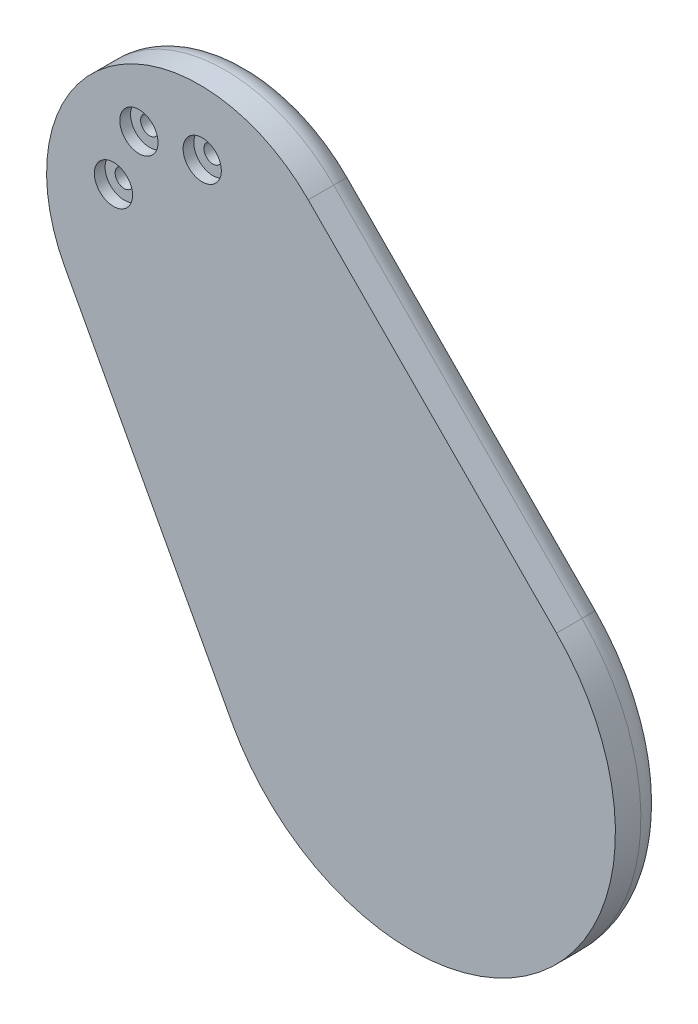
ISO-10303-21;
HEADER;
FILE_DESCRIPTION(('STEP AP214'),'2;1');
FILE_NAME('part.step','',(''),(''),'','','');
FILE_SCHEMA(('AUTOMOTIVE_DESIGN { 1 0 10303 214 1 1 1 1 }'));
ENDSEC;
DATA;
#1=APPLICATION_CONTEXT('core data for automotive mechanical design processes');
#2=APPLICATION_PROTOCOL_DEFINITION('international standard','automotive_design',2000,#1);
#3=PRODUCT_CONTEXT('',#1,'mechanical');
#4=PRODUCT('Part','Part','',(#3));
#5=PRODUCT_RELATED_PRODUCT_CATEGORY('part','',(#4));
#6=PRODUCT_DEFINITION_FORMATION('','',#4);
#7=PRODUCT_DEFINITION_CONTEXT('part definition',#1,'design');
#8=PRODUCT_DEFINITION('design','',#6,#7);
#9=PRODUCT_DEFINITION_SHAPE('','',#8);
#10=(LENGTH_UNIT() NAMED_UNIT(*) SI_UNIT(.MILLI.,.METRE.));
#11=(NAMED_UNIT(*) PLANE_ANGLE_UNIT() SI_UNIT($,.RADIAN.));
#12=(NAMED_UNIT(*) SI_UNIT($,.STERADIAN.) SOLID_ANGLE_UNIT());
#13=UNCERTAINTY_MEASURE_WITH_UNIT(LENGTH_MEASURE(1.E-05),#10,'distance_accuracy_value','');
#14=(GEOMETRIC_REPRESENTATION_CONTEXT(3) GLOBAL_UNCERTAINTY_ASSIGNED_CONTEXT((#13)) GLOBAL_UNIT_ASSIGNED_CONTEXT((#10,
#11,#12)) REPRESENTATION_CONTEXT('',''));
#15=CARTESIAN_POINT('',(0.,0.,0.));
#16=DIRECTION('',(0.,0.,1.));
#17=DIRECTION('',(1.,0.,0.));
#18=AXIS2_PLACEMENT_3D('',#15,#16,#17);
#19=CARTESIAN_POINT('',(0.,0.,-1.26999999999997));
#20=DIRECTION('',(0.,0.,1.));
#21=DIRECTION('',(1.,0.,0.));
#22=AXIS2_PLACEMENT_3D('',#19,#20,#21);
#23=PLANE('',#22);
#24=CARTESIAN_POINT('',(-52.1519440719628,93.7132213431746,-1.26999999999997));
#25=DIRECTION('',(0.,0.,1.));
#26=DIRECTION('',(1.,0.,0.));
#27=AXIS2_PLACEMENT_3D('',#24,#25,#26);
#28=CIRCLE('',#27,2.2479);
#29=CARTESIAN_POINT('',(-49.9040440719628,93.7132213431746,-1.26999999999997));
#30=VERTEX_POINT('',#29);
#31=EDGE_CURVE('E306',#30,#30,#28,.F.);
#32=ORIENTED_EDGE('',*,*,#31,.F.);
#33=EDGE_LOOP('',(#32));
#34=FACE_BOUND('',#33,.T.);
#35=CARTESIAN_POINT('',(0.,0.,-1.26999999999997));
#36=DIRECTION('',(0.,0.,1.));
#37=DIRECTION('',(1.,0.,0.));
#38=AXIS2_PLACEMENT_3D('',#35,#36,#37);
#39=CIRCLE('',#38,16.42872);
#40=CARTESIAN_POINT('',(16.42872,0.,-1.26999999999997));
#41=VERTEX_POINT('',#40);
#42=EDGE_CURVE('E150',#41,#41,#39,.T.);
#43=ORIENTED_EDGE('',*,*,#42,.T.);
#44=EDGE_LOOP('',(#43));
#45=FACE_BOUND('',#44,.T.);
#46=CARTESIAN_POINT('',(-52.8314178694251,71.4986103774484,-1.26999999999997));
#47=DIRECTION('',(0.,0.,1.));
#48=DIRECTION('',(1.,0.,0.));
#49=AXIS2_PLACEMENT_3D('',#46,#47,#48);
#50=CIRCLE('',#49,10.17778);
#51=CARTESIAN_POINT('',(-42.653637869425,71.4986103774484,-1.26999999999997));
#52=VERTEX_POINT('',#51);
#53=EDGE_CURVE('E147',#52,#52,#50,.T.);
#54=ORIENTED_EDGE('',*,*,#53,.T.);
#55=EDGE_LOOP('',(#54));
#56=FACE_BOUND('',#55,.T.);
#57=CARTESIAN_POINT('',(-52.8314178694251,71.4986103774484,-1.26999999999997));
#58=DIRECTION('',(0.,0.,1.));
#59=DIRECTION('',(1.,0.,0.));
#60=AXIS2_PLACEMENT_3D('',#57,#58,#59);
#61=CIRCLE('',#60,31.7499999999999);
#62=CARTESIAN_POINT('',(-80.8002097697655,56.4716619302272,-1.26999999999997));
#63=VERTEX_POINT('',#62);
#64=CARTESIAN_POINT('',(-30.2535869761689,93.8213353937971,-1.26999999999997));
#65=VERTEX_POINT('',#64);
#66=EDGE_CURVE('E121',#63,#65,#61,.F.);
#67=ORIENTED_EDGE('',*,*,#66,.T.);
#68=DIRECTION('',(-0.703077953270827,0.711112784039568,0.));
#69=VECTOR('',#68,1.);
#70=CARTESIAN_POINT('',(31.6089632505588,31.2518150228883,-1.26999999999997));
#71=LINE('',#70,#69);
#72=CARTESIAN_POINT('',(31.6089632505588,31.2518150228883,-1.26999999999997));
#73=VERTEX_POINT('',#72);
#74=EDGE_CURVE('E127',#65,#73,#71,.F.);
#75=ORIENTED_EDGE('',*,*,#74,.T.);
#76=CARTESIAN_POINT('',(0.,0.,-1.26999999999997));
#77=DIRECTION('',(0.,0.,1.));
#78=DIRECTION('',(1.,0.,0.));
#79=AXIS2_PLACEMENT_3D('',#76,#77,#78);
#80=CIRCLE('',#79,44.45);
#81=CARTESIAN_POINT('',(-39.1563086604768,-21.0377278261098,-1.26999999999997));
#82=VERTEX_POINT('',#81);
#83=EDGE_CURVE('E125',#73,#82,#80,.F.);
#84=ORIENTED_EDGE('',*,*,#83,.T.);
#85=DIRECTION('',(0.473289714873111,-0.880906831506789,0.));
#86=VECTOR('',#85,1.);
#87=CARTESIAN_POINT('',(-39.1563086604768,-21.0377278261098,-1.26999999999997));
#88=LINE('',#87,#86);
#89=EDGE_CURVE('E123',#82,#63,#88,.F.);
#90=ORIENTED_EDGE('',*,*,#89,.T.);
#91=EDGE_LOOP('',(#67,#75,#84,#90));
#92=FACE_BOUND('',#91,.T.);
#93=CARTESIAN_POINT('',(-74.2660915441615,77.3727392028627,-1.26999999999997));
#94=DIRECTION('',(0.,0.,1.));
#95=DIRECTION('',(1.,0.,0.));
#96=AXIS2_PLACEMENT_3D('',#93,#94,#95);
#97=CIRCLE('',#96,2.2479);
#98=CARTESIAN_POINT('',(-72.0181915441615,77.3727392028627,-1.26999999999997));
#99=VERTEX_POINT('',#98);
#100=EDGE_CURVE('E137',#99,#99,#97,.F.);
#101=ORIENTED_EDGE('',*,*,#100,.F.);
#102=EDGE_LOOP('',(#101));
#103=FACE_BOUND('',#102,.T.);
#104=CARTESIAN_POINT('',(-67.9261086892609,91.9267847710052,-1.26999999999997));
#105=DIRECTION('',(0.,0.,1.));
#106=DIRECTION('',(1.,0.,0.));
#107=AXIS2_PLACEMENT_3D('',#104,#105,#106);
#108=CIRCLE('',#107,2.2479);
#109=CARTESIAN_POINT('',(-65.6782086892609,91.9267847710052,-1.26999999999997));
#110=VERTEX_POINT('',#109);
#111=EDGE_CURVE('E288',#110,#110,#108,.F.);
#112=ORIENTED_EDGE('',*,*,#111,.F.);
#113=EDGE_LOOP('',(#112));
#114=FACE_BOUND('',#113,.T.);
#115=ADVANCED_FACE('F32',(#34,#45,#56,#92,#103,#114),#23,.F.);
#116=CARTESIAN_POINT('',(0.,0.,11.43));
#117=DIRECTION('',(0.,0.,-1.));
#118=DIRECTION('',(-1.,0.,0.));
#119=AXIS2_PLACEMENT_3D('',#116,#117,#118);
#120=CYLINDRICAL_SURFACE('',#119,50.8);
#121=DIRECTION('',(0.,0.,-1.));
#122=VECTOR('',#121,1.);
#123=CARTESIAN_POINT('',(-44.7500670405449,-24.0431175155541,11.43));
#124=LINE('',#123,#122);
#125=CARTESIAN_POINT('',(-44.7500670405449,-24.0431175155541,11.43));
#126=VERTEX_POINT('',#125);
#127=CARTESIAN_POINT('',(-44.7500670405449,-24.0431175155541,5.08000000000003));
#128=VERTEX_POINT('',#127);
#129=EDGE_CURVE('E272',#126,#128,#124,.T.);
#130=ORIENTED_EDGE('',*,*,#129,.T.);
#131=CARTESIAN_POINT('',(0.,0.,5.08000000000003));
#132=DIRECTION('',(0.,0.,1.));
#133=DIRECTION('',(1.,0.,0.));
#134=AXIS2_PLACEMENT_3D('',#131,#132,#133);
#135=CIRCLE('',#134,50.8);
#136=CARTESIAN_POINT('',(36.1245294292101,35.716360026158,5.08000000000003));
#137=VERTEX_POINT('',#136);
#138=EDGE_CURVE('E110',#128,#137,#135,.T.);
#139=ORIENTED_EDGE('',*,*,#138,.T.);
#140=DIRECTION('',(0.,0.,-1.));
#141=VECTOR('',#140,1.);
#142=CARTESIAN_POINT('',(36.1245294292101,35.716360026158,11.43));
#143=LINE('',#142,#141);
#144=CARTESIAN_POINT('',(36.1245294292101,35.716360026158,11.43));
#145=VERTEX_POINT('',#144);
#146=EDGE_CURVE('E93',#145,#137,#143,.T.);
#147=ORIENTED_EDGE('',*,*,#146,.F.);
#148=CARTESIAN_POINT('',(0.,0.,11.43));
#149=DIRECTION('',(0.,0.,1.));
#150=DIRECTION('',(1.,0.,0.));
#151=AXIS2_PLACEMENT_3D('',#148,#149,#150);
#152=CIRCLE('',#151,50.8);
#153=EDGE_CURVE('E99',#126,#145,#152,.T.);
#154=ORIENTED_EDGE('',*,*,#153,.F.);
#155=EDGE_LOOP('',(#130,#139,#147,#154));
#156=FACE_BOUND('',#155,.T.);
#157=ADVANCED_FACE('F108',(#156),#120,.T.);
#158=CARTESIAN_POINT('',(-25.7380207975176,98.2858803970668,11.43));
#159=DIRECTION('',(-0.711112784039568,-0.703077953270827,0.));
#160=DIRECTION('',(0.703077953270827,-0.711112784039568,0.));
#161=AXIS2_PLACEMENT_3D('',#158,#159,#160);
#162=PLANE('',#161);
#163=ORIENTED_EDGE('',*,*,#146,.T.);
#164=DIRECTION('',(-0.703077953270827,0.711112784039568,0.));
#165=VECTOR('',#164,1.);
#166=CARTESIAN_POINT('',(-25.7380207975176,98.2858803970668,5.08000000000003));
#167=LINE('',#166,#165);
#168=CARTESIAN_POINT('',(-25.7380207975176,98.2858803970668,5.08000000000003));
#169=VERTEX_POINT('',#168);
#170=EDGE_CURVE('E114',#137,#169,#167,.T.);
#171=ORIENTED_EDGE('',*,*,#170,.T.);
#172=DIRECTION('',(0.,0.,-1.));
#173=VECTOR('',#172,1.);
#174=CARTESIAN_POINT('',(-25.7380207975176,98.2858803970668,11.43));
#175=LINE('',#174,#173);
#176=CARTESIAN_POINT('',(-25.7380207975176,98.2858803970668,11.43));
#177=VERTEX_POINT('',#176);
#178=EDGE_CURVE('E95',#177,#169,#175,.T.);
#179=ORIENTED_EDGE('',*,*,#178,.F.);
#180=DIRECTION('',(-0.703077953270827,0.711112784039568,0.));
#181=VECTOR('',#180,1.);
#182=CARTESIAN_POINT('',(-25.7380207975176,98.2858803970668,11.43));
#183=LINE('',#182,#181);
#184=EDGE_CURVE('E88',#145,#177,#183,.T.);
#185=ORIENTED_EDGE('',*,*,#184,.F.);
#186=EDGE_LOOP('',(#163,#171,#179,#185));
#187=FACE_BOUND('',#186,.T.);
#188=ADVANCED_FACE('F90',(#187),#162,.F.);
#189=CARTESIAN_POINT('',(-52.8314178694251,71.4986103774484,11.43));
#190=DIRECTION('',(0.,0.,-1.));
#191=DIRECTION('',(-1.,0.,0.));
#192=AXIS2_PLACEMENT_3D('',#189,#190,#191);
#193=CYLINDRICAL_SURFACE('',#192,38.0999999999999);
#194=ORIENTED_EDGE('',*,*,#178,.T.);
#195=CARTESIAN_POINT('',(-52.8314178694251,71.4986103774484,5.08000000000003));
#196=DIRECTION('',(0.,0.,1.));
#197=DIRECTION('',(1.,0.,0.));
#198=AXIS2_PLACEMENT_3D('',#195,#196,#197);
#199=CIRCLE('',#198,38.0999999999999);
#200=CARTESIAN_POINT('',(-86.3939681498336,53.4662722407829,5.08000000000003));
#201=VERTEX_POINT('',#200);
#202=EDGE_CURVE('E47',#169,#201,#199,.T.);
#203=ORIENTED_EDGE('',*,*,#202,.T.);
#204=DIRECTION('',(0.,0.,-1.));
#205=VECTOR('',#204,1.);
#206=CARTESIAN_POINT('',(-86.3939681498336,53.4662722407829,11.43));
#207=LINE('',#206,#205);
#208=CARTESIAN_POINT('',(-86.3939681498336,53.4662722407829,11.43));
#209=VERTEX_POINT('',#208);
#210=EDGE_CURVE('E116',#209,#201,#207,.T.);
#211=ORIENTED_EDGE('',*,*,#210,.F.);
#212=CARTESIAN_POINT('',(-52.8314178694251,71.4986103774484,11.43));
#213=DIRECTION('',(0.,0.,1.));
#214=DIRECTION('',(1.,0.,0.));
#215=AXIS2_PLACEMENT_3D('',#212,#213,#214);
#216=CIRCLE('',#215,38.0999999999999);
#217=EDGE_CURVE('E98',#177,#209,#216,.T.);
#218=ORIENTED_EDGE('',*,*,#217,.F.);
#219=EDGE_LOOP('',(#194,#203,#211,#218));
#220=FACE_BOUND('',#219,.T.);
#221=ADVANCED_FACE('F208',(#220),#193,.T.);
#222=CARTESIAN_POINT('',(-44.7500670405449,-24.0431175155541,11.43));
#223=DIRECTION('',(0.880906831506788,0.473289714873111,0.));
#224=DIRECTION('',(-0.473289714873111,0.880906831506789,0.));
#225=AXIS2_PLACEMENT_3D('',#222,#223,#224);
#226=PLANE('',#225);
#227=ORIENTED_EDGE('',*,*,#210,.T.);
#228=DIRECTION('',(0.473289714873111,-0.880906831506789,0.));
#229=VECTOR('',#228,1.);
#230=CARTESIAN_POINT('',(-44.7500670405449,-24.0431175155541,5.08000000000003));
#231=LINE('',#230,#229);
#232=EDGE_CURVE('E54',#201,#128,#231,.T.);
#233=ORIENTED_EDGE('',*,*,#232,.T.);
#234=ORIENTED_EDGE('',*,*,#129,.F.);
#235=DIRECTION('',(0.473289714873111,-0.880906831506788,0.));
#236=VECTOR('',#235,1.);
#237=CARTESIAN_POINT('',(-44.7500670405449,-24.0431175155541,11.43));
#238=LINE('',#237,#236);
#239=EDGE_CURVE('E104',#209,#126,#238,.T.);
#240=ORIENTED_EDGE('',*,*,#239,.F.);
#241=EDGE_LOOP('',(#227,#233,#234,#240));
#242=FACE_BOUND('',#241,.T.);
#243=ADVANCED_FACE('F205',(#242),#226,.F.);
#244=CARTESIAN_POINT('',(0.,0.,11.43));
#245=DIRECTION('',(0.,0.,1.));
#246=DIRECTION('',(1.,0.,0.));
#247=AXIS2_PLACEMENT_3D('',#244,#245,#246);
#248=PLANE('',#247);
#249=CARTESIAN_POINT('',(-52.1519440719628,93.7132213431746,11.43));
#250=DIRECTION('',(0.,0.,1.));
#251=DIRECTION('',(1.,0.,0.));
#252=AXIS2_PLACEMENT_3D('',#249,#250,#251);
#253=CIRCLE('',#252,4.7625);
#254=CARTESIAN_POINT('',(-47.3894440719628,93.7132213431746,11.43));
#255=VERTEX_POINT('',#254);
#256=EDGE_CURVE('E512',#255,#255,#253,.T.);
#257=ORIENTED_EDGE('',*,*,#256,.F.);
#258=EDGE_LOOP('',(#257));
#259=FACE_BOUND('',#258,.T.);
#260=CARTESIAN_POINT('',(-67.9261086892609,91.9267847710052,11.43));
#261=DIRECTION('',(0.,0.,1.));
#262=DIRECTION('',(1.,0.,0.));
#263=AXIS2_PLACEMENT_3D('',#260,#261,#262);
#264=CIRCLE('',#263,4.76249999999999);
#265=CARTESIAN_POINT('',(-63.1636086892609,91.9267847710052,11.43));
#266=VERTEX_POINT('',#265);
#267=EDGE_CURVE('E303',#266,#266,#264,.T.);
#268=ORIENTED_EDGE('',*,*,#267,.F.);
#269=EDGE_LOOP('',(#268));
#270=FACE_BOUND('',#269,.T.);
#271=CARTESIAN_POINT('',(-74.2660915441615,77.3727392028627,11.43));
#272=DIRECTION('',(0.,0.,1.));
#273=DIRECTION('',(1.,0.,0.));
#274=AXIS2_PLACEMENT_3D('',#271,#272,#273);
#275=CIRCLE('',#274,4.76249999999999);
#276=CARTESIAN_POINT('',(-69.5035915441615,77.3727392028627,11.43));
#277=VERTEX_POINT('',#276);
#278=EDGE_CURVE('E290',#277,#277,#275,.T.);
#279=ORIENTED_EDGE('',*,*,#278,.F.);
#280=EDGE_LOOP('',(#279));
#281=FACE_BOUND('',#280,.T.);
#282=ORIENTED_EDGE('',*,*,#153,.T.);
#283=ORIENTED_EDGE('',*,*,#184,.T.);
#284=ORIENTED_EDGE('',*,*,#217,.T.);
#285=ORIENTED_EDGE('',*,*,#239,.T.);
#286=EDGE_LOOP('',(#282,#283,#284,#285));
#287=FACE_BOUND('',#286,.T.);
#288=ADVANCED_FACE('F102',(#259,#270,#281,#287),#248,.T.);
#289=CARTESIAN_POINT('',(0.,0.,-48.8082323760076));
#290=DIRECTION('',(0.,0.,1.));
#291=DIRECTION('',(1.,0.,0.));
#292=AXIS2_PLACEMENT_3D('',#289,#290,#291);
#293=CYLINDRICAL_SURFACE('',#292,13.88872);
#294=CARTESIAN_POINT('',(0.,0.,-9.27100000000261));
#295=DIRECTION('',(0.,0.,-1.));
#296=DIRECTION('',(-1.,0.,0.));
#297=AXIS2_PLACEMENT_3D('',#294,#295,#296);
#298=CIRCLE('',#297,13.88872);
#299=CARTESIAN_POINT('',(-13.88872,0.,-9.27100000000261));
#300=VERTEX_POINT('',#299);
#301=EDGE_CURVE('E171',#300,#300,#298,.F.);
#302=ORIENTED_EDGE('',*,*,#301,.T.);
#303=EDGE_LOOP('',(#302));
#304=FACE_BOUND('',#303,.T.);
#305=CARTESIAN_POINT('',(0.,0.,-3.80999999999997));
#306=DIRECTION('',(0.,0.,1.));
#307=DIRECTION('',(1.,0.,0.));
#308=AXIS2_PLACEMENT_3D('',#305,#306,#307);
#309=CIRCLE('',#308,13.88872);
#310=CARTESIAN_POINT('',(13.88872,0.,-3.80999999999997));
#311=VERTEX_POINT('',#310);
#312=EDGE_CURVE('E133',#311,#311,#309,.F.);
#313=ORIENTED_EDGE('',*,*,#312,.T.);
#314=EDGE_LOOP('',(#313));
#315=FACE_BOUND('',#314,.T.);
#316=ADVANCED_FACE('F334',(#304,#315),#293,.T.);
#317=CARTESIAN_POINT('',(0.974356089486769,-13.85450011546,-9.52500000000261));
#318=DIRECTION('',(0.,0.,-1.));
#319=DIRECTION('',(0.997536138352559,0.0701544915216637,0.));
#320=AXIS2_PLACEMENT_3D('',#317,#318,#319);
#321=PLANE('',#320);
#322=CARTESIAN_POINT('',(0.,0.,-9.52500000000261));
#323=DIRECTION('',(0.,0.,-1.));
#324=DIRECTION('',(-1.,0.,0.));
#325=AXIS2_PLACEMENT_3D('',#322,#323,#324);
#326=CIRCLE('',#325,13.63472);
#327=CARTESIAN_POINT('',(-13.63472,0.,-9.52500000000261));
#328=VERTEX_POINT('',#327);
#329=EDGE_CURVE('E168',#328,#328,#326,.T.);
#330=ORIENTED_EDGE('',*,*,#329,.T.);
#331=EDGE_LOOP('',(#330));
#332=FACE_BOUND('',#331,.T.);
#333=CARTESIAN_POINT('',(0.,0.,-9.52500000000262));
#334=DIRECTION('',(0.,0.,-1.));
#335=DIRECTION('',(-1.,0.,0.));
#336=AXIS2_PLACEMENT_3D('',#333,#334,#335);
#337=CIRCLE('',#336,6.35);
#338=CARTESIAN_POINT('',(-6.35,0.,-9.52500000000261));
#339=VERTEX_POINT('',#338);
#340=EDGE_CURVE('E111',#339,#339,#337,.F.);
#341=ORIENTED_EDGE('',*,*,#340,.T.);
#342=EDGE_LOOP('',(#341));
#343=FACE_BOUND('',#342,.T.);
#344=ADVANCED_FACE('F217',(#332,#343),#321,.T.);
#345=CARTESIAN_POINT('',(0.47345722929158,-6.73215193979104,-15.8750000000026));
#346=DIRECTION('',(0.,0.,1.));
#347=DIRECTION('',(-0.997536138352559,-0.0701544915216637,0.));
#348=AXIS2_PLACEMENT_3D('',#345,#346,#347);
#349=PLANE('',#348);
#350=CARTESIAN_POINT('',(0.,0.,-15.8750000000026));
#351=DIRECTION('',(0.,0.,1.));
#352=DIRECTION('',(1.,0.,0.));
#353=AXIS2_PLACEMENT_3D('',#350,#351,#352);
#354=CIRCLE('',#353,5.715);
#355=CARTESIAN_POINT('',(5.715,0.,-15.8750000000026));
#356=VERTEX_POINT('',#355);
#357=EDGE_CURVE('E156',#356,#356,#354,.F.);
#358=ORIENTED_EDGE('',*,*,#357,.T.);
#359=EDGE_LOOP('',(#358));
#360=FACE_BOUND('',#359,.T.);
#361=ADVANCED_FACE('F213',(#360),#349,.F.);
#362=CARTESIAN_POINT('',(0.,0.,-33.8355122421409));
#363=DIRECTION('',(0.,0.,1.));
#364=DIRECTION('',(1.,0.,0.));
#365=AXIS2_PLACEMENT_3D('',#362,#363,#364);
#366=CYLINDRICAL_SURFACE('',#365,6.35);
#367=CARTESIAN_POINT('',(0.,0.,-15.2400000000026));
#368=DIRECTION('',(0.,0.,1.));
#369=DIRECTION('',(1.,0.,0.));
#370=AXIS2_PLACEMENT_3D('',#367,#368,#369);
#371=CIRCLE('',#370,6.35);
#372=CARTESIAN_POINT('',(6.35,0.,-15.2400000000026));
#373=VERTEX_POINT('',#372);
#374=EDGE_CURVE('E159',#373,#373,#371,.T.);
#375=ORIENTED_EDGE('',*,*,#374,.T.);
#376=EDGE_LOOP('',(#375));
#377=FACE_BOUND('',#376,.T.);
#378=ORIENTED_EDGE('',*,*,#340,.F.);
#379=EDGE_LOOP('',(#378));
#380=FACE_BOUND('',#379,.T.);
#381=ADVANCED_FACE('F216',(#377,#380),#366,.T.);
#382=CARTESIAN_POINT('',(-52.8314178694251,71.4986103774484,-28.0545041248458));
#383=DIRECTION('',(0.,0.,1.));
#384=DIRECTION('',(1.,0.,0.));
#385=AXIS2_PLACEMENT_3D('',#382,#383,#384);
#386=CYLINDRICAL_SURFACE('',#385,7.63778000000001);
#387=CARTESIAN_POINT('',(-52.8314178694251,71.4986103774484,-6.19760000000179));
#388=DIRECTION('',(0.,0.,-1.));
#389=DIRECTION('',(-1.,0.,0.));
#390=AXIS2_PLACEMENT_3D('',#387,#388,#389);
#391=CIRCLE('',#390,7.63778000000001);
#392=CARTESIAN_POINT('',(-60.4691978694251,71.4986103774484,-6.19760000000179));
#393=VERTEX_POINT('',#392);
#394=EDGE_CURVE('E11',#393,#393,#391,.F.);
#395=ORIENTED_EDGE('',*,*,#394,.T.);
#396=EDGE_LOOP('',(#395));
#397=FACE_BOUND('',#396,.T.);
#398=CARTESIAN_POINT('',(-52.8314178694251,71.4986103774484,-3.80999999999997));
#399=DIRECTION('',(0.,0.,1.));
#400=DIRECTION('',(1.,0.,0.));
#401=AXIS2_PLACEMENT_3D('',#398,#399,#400);
#402=CIRCLE('',#401,7.63778000000001);
#403=CARTESIAN_POINT('',(-45.193637869425,71.4986103774484,-3.80999999999997));
#404=VERTEX_POINT('',#403);
#405=EDGE_CURVE('E153',#404,#404,#402,.F.);
#406=ORIENTED_EDGE('',*,*,#405,.T.);
#407=EDGE_LOOP('',(#406));
#408=FACE_BOUND('',#407,.T.);
#409=ADVANCED_FACE('F221',(#397,#408),#386,.T.);
#410=CARTESIAN_POINT('',(-45.3800836815725,73.1759004982502,-6.4516000000018));
#411=DIRECTION('',(0.,0.,-1.));
#412=DIRECTION('',(-0.219604403478726,0.975589004639122,0.));
#413=AXIS2_PLACEMENT_3D('',#410,#411,#412);
#414=PLANE('',#413);
#415=CARTESIAN_POINT('',(-52.8314178694251,71.4986103774484,-6.45160000000179));
#416=DIRECTION('',(0.,0.,-1.));
#417=DIRECTION('',(-1.,0.,0.));
#418=AXIS2_PLACEMENT_3D('',#415,#416,#417);
#419=CIRCLE('',#418,7.38378000000001);
#420=CARTESIAN_POINT('',(-60.2151978694251,71.4986103774484,-6.45160000000179));
#421=VERTEX_POINT('',#420);
#422=EDGE_CURVE('E40',#421,#421,#419,.T.);
#423=ORIENTED_EDGE('',*,*,#422,.T.);
#424=EDGE_LOOP('',(#423));
#425=FACE_BOUND('',#424,.T.);
#426=CARTESIAN_POINT('',(-52.8314178694251,71.4986103774485,-6.45160000000179));
#427=DIRECTION('',(0.,0.,-1.));
#428=DIRECTION('',(-1.,0.,0.));
#429=AXIS2_PLACEMENT_3D('',#426,#427,#428);
#430=CIRCLE('',#429,3.175);
#431=CARTESIAN_POINT('',(-56.0064178694251,71.4986103774485,-6.45160000000179));
#432=VERTEX_POINT('',#431);
#433=EDGE_CURVE('E106',#432,#432,#430,.T.);
#434=ORIENTED_EDGE('',*,*,#433,.F.);
#435=EDGE_LOOP('',(#434));
#436=FACE_BOUND('',#435,.T.);
#437=ADVANCED_FACE('F176',(#425,#436),#414,.T.);
#438=CARTESIAN_POINT('',(-49.4415192432254,72.261674190304,-11.4300000000018));
#439=DIRECTION('',(0.,0.,1.));
#440=DIRECTION('',(0.219604403478726,-0.975589004639122,0.));
#441=AXIS2_PLACEMENT_3D('',#438,#439,#440);
#442=PLANE('',#441);
#443=CARTESIAN_POINT('',(-52.8314178694251,71.4986103774485,-11.4300000000018));
#444=DIRECTION('',(0.,0.,1.));
#445=DIRECTION('',(1.,0.,0.));
#446=AXIS2_PLACEMENT_3D('',#443,#444,#445);
#447=CIRCLE('',#446,2.54);
#448=CARTESIAN_POINT('',(-50.2914178694251,71.4986103774485,-11.4300000000018));
#449=VERTEX_POINT('',#448);
#450=EDGE_CURVE('E165',#449,#449,#447,.F.);
#451=ORIENTED_EDGE('',*,*,#450,.T.);
#452=EDGE_LOOP('',(#451));
#453=FACE_BOUND('',#452,.T.);
#454=ADVANCED_FACE('F262',(#453),#442,.F.);
#455=CARTESIAN_POINT('',(-52.8314178694251,71.4986103774485,-20.4102561210709));
#456=DIRECTION('',(0.,0.,1.));
#457=DIRECTION('',(1.,0.,0.));
#458=AXIS2_PLACEMENT_3D('',#455,#456,#457);
#459=CYLINDRICAL_SURFACE('',#458,3.175);
#460=CARTESIAN_POINT('',(-52.8314178694251,71.4986103774485,-10.7950000000018));
#461=DIRECTION('',(0.,0.,1.));
#462=DIRECTION('',(1.,0.,0.));
#463=AXIS2_PLACEMENT_3D('',#460,#461,#462);
#464=CIRCLE('',#463,3.175);
#465=CARTESIAN_POINT('',(-49.6564178694251,71.4986103774485,-10.7950000000018));
#466=VERTEX_POINT('',#465);
#467=EDGE_CURVE('E162',#466,#466,#464,.T.);
#468=ORIENTED_EDGE('',*,*,#467,.T.);
#469=EDGE_LOOP('',(#468));
#470=FACE_BOUND('',#469,.T.);
#471=ORIENTED_EDGE('',*,*,#433,.T.);
#472=EDGE_LOOP('',(#471));
#473=FACE_BOUND('',#472,.T.);
#474=ADVANCED_FACE('F239',(#470,#473),#459,.T.);
#475=CARTESIAN_POINT('',(-39.1563086604768,-21.0377278261098,5.08000000000003));
#476=DIRECTION('',(0.473289714873111,-0.880906831506789,0.));
#477=DIRECTION('',(0.880906831506788,0.473289714873111,0.));
#478=AXIS2_PLACEMENT_3D('',#475,#476,#477);
#479=CYLINDRICAL_SURFACE('',#478,6.35);
#480=CARTESIAN_POINT('',(-80.8002097697655,56.4716619302272,5.08000000000003));
#481=DIRECTION('',(-0.473289714873111,0.880906831506788,0.));
#482=DIRECTION('',(-0.880906831506788,-0.473289714873111,0.));
#483=AXIS2_PLACEMENT_3D('',#480,#481,#482);
#484=CIRCLE('',#483,6.35);
#485=EDGE_CURVE('E139',#63,#201,#484,.T.);
#486=ORIENTED_EDGE('',*,*,#485,.F.);
#487=ORIENTED_EDGE('',*,*,#89,.F.);
#488=CARTESIAN_POINT('',(-39.1563086604768,-21.0377278261098,5.08000000000003));
#489=DIRECTION('',(0.473289714873111,-0.880906831506788,0.));
#490=DIRECTION('',(0.880906831506788,0.473289714873111,0.));
#491=AXIS2_PLACEMENT_3D('',#488,#489,#490);
#492=CIRCLE('',#491,6.35);
#493=EDGE_CURVE('E142',#128,#82,#492,.T.);
#494=ORIENTED_EDGE('',*,*,#493,.F.);
#495=ORIENTED_EDGE('',*,*,#232,.F.);
#496=EDGE_LOOP('',(#486,#487,#494,#495));
#497=FACE_BOUND('',#496,.T.);
#498=ADVANCED_FACE('F235',(#497),#479,.T.);
#499=CARTESIAN_POINT('',(0.,0.,5.08000000000003));
#500=DIRECTION('',(0.,0.,1.));
#501=DIRECTION('',(1.,0.,0.));
#502=AXIS2_PLACEMENT_3D('',#499,#500,#501);
#503=TOROIDAL_SURFACE('',#502,44.45,6.35);
#504=ORIENTED_EDGE('',*,*,#493,.T.);
#505=ORIENTED_EDGE('',*,*,#83,.F.);
#506=CARTESIAN_POINT('',(31.6089632505588,31.2518150228883,5.08000000000003));
#507=DIRECTION('',(-0.703077953270827,0.711112784039568,0.));
#508=DIRECTION('',(-0.711112784039568,-0.703077953270827,0.));
#509=AXIS2_PLACEMENT_3D('',#506,#507,#508);
#510=CIRCLE('',#509,6.35);
#511=EDGE_CURVE('E136',#137,#73,#510,.T.);
#512=ORIENTED_EDGE('',*,*,#511,.F.);
#513=ORIENTED_EDGE('',*,*,#138,.F.);
#514=EDGE_LOOP('',(#504,#505,#512,#513));
#515=FACE_BOUND('',#514,.T.);
#516=ADVANCED_FACE('F231',(#515),#503,.T.);
#517=CARTESIAN_POINT('',(-52.8314178694251,71.4986103774484,5.08000000000003));
#518=DIRECTION('',(0.,0.,1.));
#519=DIRECTION('',(1.,0.,0.));
#520=AXIS2_PLACEMENT_3D('',#517,#518,#519);
#521=TOROIDAL_SURFACE('',#520,31.7499999999999,6.35);
#522=ORIENTED_EDGE('',*,*,#485,.T.);
#523=ORIENTED_EDGE('',*,*,#202,.F.);
#524=CARTESIAN_POINT('',(-30.2535869761689,93.8213353937971,5.08000000000003));
#525=DIRECTION('',(0.703077953270826,-0.711112784039568,0.));
#526=DIRECTION('',(0.711112784039568,0.703077953270826,0.));
#527=AXIS2_PLACEMENT_3D('',#524,#525,#526);
#528=CIRCLE('',#527,6.35);
#529=EDGE_CURVE('E134',#65,#169,#528,.T.);
#530=ORIENTED_EDGE('',*,*,#529,.F.);
#531=ORIENTED_EDGE('',*,*,#66,.F.);
#532=EDGE_LOOP('',(#522,#523,#530,#531));
#533=FACE_BOUND('',#532,.T.);
#534=ADVANCED_FACE('F227',(#533),#521,.T.);
#535=CARTESIAN_POINT('',(-30.2535869761688,93.8213353937971,5.08000000000003));
#536=DIRECTION('',(-0.703077953270827,0.711112784039568,0.));
#537=DIRECTION('',(-0.711112784039568,-0.703077953270827,0.));
#538=AXIS2_PLACEMENT_3D('',#535,#536,#537);
#539=CYLINDRICAL_SURFACE('',#538,6.35);
#540=ORIENTED_EDGE('',*,*,#511,.T.);
#541=ORIENTED_EDGE('',*,*,#74,.F.);
#542=ORIENTED_EDGE('',*,*,#529,.T.);
#543=ORIENTED_EDGE('',*,*,#170,.F.);
#544=EDGE_LOOP('',(#540,#541,#542,#543));
#545=FACE_BOUND('',#544,.T.);
#546=ADVANCED_FACE('F223',(#545),#539,.T.);
#547=CARTESIAN_POINT('',(0.,0.,-3.80999999999997));
#548=DIRECTION('',(0.,0.,1.));
#549=DIRECTION('',(1.,0.,0.));
#550=AXIS2_PLACEMENT_3D('',#547,#548,#549);
#551=TOROIDAL_SURFACE('',#550,16.42872,2.54);
#552=ORIENTED_EDGE('',*,*,#42,.F.);
#553=EDGE_LOOP('',(#552));
#554=FACE_BOUND('',#553,.T.);
#555=ORIENTED_EDGE('',*,*,#312,.F.);
#556=EDGE_LOOP('',(#555));
#557=FACE_BOUND('',#556,.T.);
#558=ADVANCED_FACE('F226',(#554,#557),#551,.F.);
#559=CARTESIAN_POINT('',(-52.8314178694251,71.4986103774484,-3.80999999999997));
#560=DIRECTION('',(0.,0.,1.));
#561=DIRECTION('',(1.,0.,0.));
#562=AXIS2_PLACEMENT_3D('',#559,#560,#561);
#563=TOROIDAL_SURFACE('',#562,10.17778,2.54);
#564=ORIENTED_EDGE('',*,*,#53,.F.);
#565=EDGE_LOOP('',(#564));
#566=FACE_BOUND('',#565,.T.);
#567=ORIENTED_EDGE('',*,*,#405,.F.);
#568=EDGE_LOOP('',(#567));
#569=FACE_BOUND('',#568,.T.);
#570=ADVANCED_FACE('F243',(#566,#569),#563,.F.);
#571=CARTESIAN_POINT('',(0.,0.,-15.2400000000026));
#572=DIRECTION('',(0.,0.,1.));
#573=DIRECTION('',(1.,0.,0.));
#574=AXIS2_PLACEMENT_3D('',#571,#572,#573);
#575=TOROIDAL_SURFACE('',#574,5.715,0.635);
#576=ORIENTED_EDGE('',*,*,#374,.F.);
#577=EDGE_LOOP('',(#576));
#578=FACE_BOUND('',#577,.T.);
#579=ORIENTED_EDGE('',*,*,#357,.F.);
#580=EDGE_LOOP('',(#579));
#581=FACE_BOUND('',#580,.T.);
#582=ADVANCED_FACE('F247',(#578,#581),#575,.T.);
#583=CARTESIAN_POINT('',(-52.8314178694251,71.4986103774485,-10.7950000000018));
#584=DIRECTION('',(0.,0.,1.));
#585=DIRECTION('',(1.,0.,0.));
#586=AXIS2_PLACEMENT_3D('',#583,#584,#585);
#587=TOROIDAL_SURFACE('',#586,2.54,0.635);
#588=ORIENTED_EDGE('',*,*,#450,.F.);
#589=EDGE_LOOP('',(#588));
#590=FACE_BOUND('',#589,.T.);
#591=ORIENTED_EDGE('',*,*,#467,.F.);
#592=EDGE_LOOP('',(#591));
#593=FACE_BOUND('',#592,.T.);
#594=ADVANCED_FACE('F190',(#590,#593),#587,.T.);
#595=CARTESIAN_POINT('',(0.,0.,-9.27100000000261));
#596=DIRECTION('',(0.,0.,-1.));
#597=DIRECTION('',(-1.,0.,0.));
#598=AXIS2_PLACEMENT_3D('',#595,#596,#597);
#599=TOROIDAL_SURFACE('',#598,13.63472,0.254);
#600=ORIENTED_EDGE('',*,*,#301,.F.);
#601=EDGE_LOOP('',(#600));
#602=FACE_BOUND('',#601,.T.);
#603=ORIENTED_EDGE('',*,*,#329,.F.);
#604=EDGE_LOOP('',(#603));
#605=FACE_BOUND('',#604,.T.);
#606=ADVANCED_FACE('F181',(#602,#605),#599,.T.);
#607=CARTESIAN_POINT('',(-52.8314178694251,71.4986103774484,-6.19760000000179));
#608=DIRECTION('',(0.,0.,-1.));
#609=DIRECTION('',(-1.,0.,0.));
#610=AXIS2_PLACEMENT_3D('',#607,#608,#609);
#611=TOROIDAL_SURFACE('',#610,7.38378000000001,0.254);
#612=ORIENTED_EDGE('',*,*,#394,.F.);
#613=EDGE_LOOP('',(#612));
#614=FACE_BOUND('',#613,.T.);
#615=ORIENTED_EDGE('',*,*,#422,.F.);
#616=EDGE_LOOP('',(#615));
#617=FACE_BOUND('',#616,.T.);
#618=ADVANCED_FACE('F34',(#614,#617),#611,.T.);
#619=CARTESIAN_POINT('',(-74.2660915441615,77.3727392028627,11.43));
#620=DIRECTION('',(0.,0.,1.));
#621=DIRECTION('',(1.,0.,0.));
#622=AXIS2_PLACEMENT_3D('',#619,#620,#621);
#623=CYLINDRICAL_SURFACE('',#622,2.2479);
#624=ORIENTED_EDGE('',*,*,#100,.T.);
#625=EDGE_LOOP('',(#624));
#626=FACE_BOUND('',#625,.T.);
#627=CARTESIAN_POINT('',(-74.2660915441615,77.3727392028627,8.76300000000003));
#628=DIRECTION('',(0.,0.,1.));
#629=DIRECTION('',(1.,0.,0.));
#630=AXIS2_PLACEMENT_3D('',#627,#628,#629);
#631=CIRCLE('',#630,2.2479);
#632=CARTESIAN_POINT('',(-72.0181915441615,77.3727392028627,8.76300000000003));
#633=VERTEX_POINT('',#632);
#634=EDGE_CURVE('E267',#633,#633,#631,.T.);
#635=ORIENTED_EDGE('',*,*,#634,.T.);
#636=EDGE_LOOP('',(#635));
#637=FACE_BOUND('',#636,.T.);
#638=ADVANCED_FACE('F180',(#626,#637),#623,.F.);
#639=CARTESIAN_POINT('',(-72.0181915441615,77.3727392028627,8.76300000000003));
#640=DIRECTION('',(0.,0.,-1.));
#641=DIRECTION('',(-1.,0.,0.));
#642=AXIS2_PLACEMENT_3D('',#639,#640,#641);
#643=PLANE('',#642);
#644=ORIENTED_EDGE('',*,*,#634,.F.);
#645=EDGE_LOOP('',(#644));
#646=FACE_BOUND('',#645,.T.);
#647=CARTESIAN_POINT('',(-74.2660915441615,77.3727392028627,8.76300000000003));
#648=DIRECTION('',(0.,0.,1.));
#649=DIRECTION('',(1.,0.,0.));
#650=AXIS2_PLACEMENT_3D('',#647,#648,#649);
#651=CIRCLE('',#650,4.7625);
#652=CARTESIAN_POINT('',(-69.5035915441615,77.3727392028627,8.76300000000003));
#653=VERTEX_POINT('',#652);
#654=EDGE_CURVE('E294',#653,#653,#651,.T.);
#655=ORIENTED_EDGE('',*,*,#654,.T.);
#656=EDGE_LOOP('',(#655));
#657=FACE_BOUND('',#656,.T.);
#658=ADVANCED_FACE('F187',(#646,#657),#643,.F.);
#659=CARTESIAN_POINT('',(-74.2660915441615,77.3727392028627,11.43));
#660=DIRECTION('',(0.,0.,1.));
#661=DIRECTION('',(1.,0.,0.));
#662=AXIS2_PLACEMENT_3D('',#659,#660,#661);
#663=CYLINDRICAL_SURFACE('',#662,4.7625);
#664=ORIENTED_EDGE('',*,*,#654,.F.);
#665=EDGE_LOOP('',(#664));
#666=FACE_BOUND('',#665,.T.);
#667=ORIENTED_EDGE('',*,*,#278,.T.);
#668=EDGE_LOOP('',(#667));
#669=FACE_BOUND('',#668,.T.);
#670=ADVANCED_FACE('F317',(#666,#669),#663,.F.);
#671=CARTESIAN_POINT('',(-67.9261086892609,91.9267847710052,11.43));
#672=DIRECTION('',(0.,0.,1.));
#673=DIRECTION('',(1.,0.,0.));
#674=AXIS2_PLACEMENT_3D('',#671,#672,#673);
#675=CYLINDRICAL_SURFACE('',#674,2.2479);
#676=ORIENTED_EDGE('',*,*,#111,.T.);
#677=EDGE_LOOP('',(#676));
#678=FACE_BOUND('',#677,.T.);
#679=CARTESIAN_POINT('',(-67.9261086892609,91.9267847710052,8.76300000000003));
#680=DIRECTION('',(0.,0.,1.));
#681=DIRECTION('',(1.,0.,0.));
#682=AXIS2_PLACEMENT_3D('',#679,#680,#681);
#683=CIRCLE('',#682,2.2479);
#684=CARTESIAN_POINT('',(-65.6782086892609,91.9267847710052,8.76300000000003));
#685=VERTEX_POINT('',#684);
#686=EDGE_CURVE('E291',#685,#685,#683,.T.);
#687=ORIENTED_EDGE('',*,*,#686,.T.);
#688=EDGE_LOOP('',(#687));
#689=FACE_BOUND('',#688,.T.);
#690=ADVANCED_FACE('F322',(#678,#689),#675,.F.);
#691=CARTESIAN_POINT('',(-65.6782086892609,91.9267847710052,8.76300000000003));
#692=DIRECTION('',(0.,0.,-1.));
#693=DIRECTION('',(-1.,0.,0.));
#694=AXIS2_PLACEMENT_3D('',#691,#692,#693);
#695=PLANE('',#694);
#696=ORIENTED_EDGE('',*,*,#686,.F.);
#697=EDGE_LOOP('',(#696));
#698=FACE_BOUND('',#697,.T.);
#699=CARTESIAN_POINT('',(-67.9261086892609,91.9267847710052,8.76300000000003));
#700=DIRECTION('',(0.,0.,1.));
#701=DIRECTION('',(1.,0.,0.));
#702=AXIS2_PLACEMENT_3D('',#699,#700,#701);
#703=CIRCLE('',#702,4.7625);
#704=CARTESIAN_POINT('',(-63.1636086892609,91.9267847710052,8.76300000000003));
#705=VERTEX_POINT('',#704);
#706=EDGE_CURVE('E297',#705,#705,#703,.T.);
#707=ORIENTED_EDGE('',*,*,#706,.T.);
#708=EDGE_LOOP('',(#707));
#709=FACE_BOUND('',#708,.T.);
#710=ADVANCED_FACE('F454',(#698,#709),#695,.F.);
#711=CARTESIAN_POINT('',(-67.9261086892609,91.9267847710052,11.43));
#712=DIRECTION('',(0.,0.,1.));
#713=DIRECTION('',(1.,0.,0.));
#714=AXIS2_PLACEMENT_3D('',#711,#712,#713);
#715=CYLINDRICAL_SURFACE('',#714,4.7625);
#716=ORIENTED_EDGE('',*,*,#706,.F.);
#717=EDGE_LOOP('',(#716));
#718=FACE_BOUND('',#717,.T.);
#719=ORIENTED_EDGE('',*,*,#267,.T.);
#720=EDGE_LOOP('',(#719));
#721=FACE_BOUND('',#720,.T.);
#722=ADVANCED_FACE('F462',(#718,#721),#715,.F.);
#723=CARTESIAN_POINT('',(-52.1519440719628,93.7132213431746,11.43));
#724=DIRECTION('',(0.,0.,1.));
#725=DIRECTION('',(1.,0.,0.));
#726=AXIS2_PLACEMENT_3D('',#723,#724,#725);
#727=CYLINDRICAL_SURFACE('',#726,2.2479);
#728=ORIENTED_EDGE('',*,*,#31,.T.);
#729=EDGE_LOOP('',(#728));
#730=FACE_BOUND('',#729,.T.);
#731=CARTESIAN_POINT('',(-52.1519440719628,93.7132213431746,8.76300000000003));
#732=DIRECTION('',(0.,0.,1.));
#733=DIRECTION('',(1.,0.,0.));
#734=AXIS2_PLACEMENT_3D('',#731,#732,#733);
#735=CIRCLE('',#734,2.2479);
#736=CARTESIAN_POINT('',(-49.9040440719628,93.7132213431746,8.76300000000003));
#737=VERTEX_POINT('',#736);
#738=EDGE_CURVE('E301',#737,#737,#735,.T.);
#739=ORIENTED_EDGE('',*,*,#738,.T.);
#740=EDGE_LOOP('',(#739));
#741=FACE_BOUND('',#740,.T.);
#742=ADVANCED_FACE('F472',(#730,#741),#727,.F.);
#743=CARTESIAN_POINT('',(-49.9040440719628,93.7132213431746,8.76300000000003));
#744=DIRECTION('',(0.,0.,-1.));
#745=DIRECTION('',(-1.,0.,0.));
#746=AXIS2_PLACEMENT_3D('',#743,#744,#745);
#747=PLANE('',#746);
#748=ORIENTED_EDGE('',*,*,#738,.F.);
#749=EDGE_LOOP('',(#748));
#750=FACE_BOUND('',#749,.T.);
#751=CARTESIAN_POINT('',(-52.1519440719628,93.7132213431746,8.76300000000003));
#752=DIRECTION('',(0.,0.,1.));
#753=DIRECTION('',(1.,0.,0.));
#754=AXIS2_PLACEMENT_3D('',#751,#752,#753);
#755=CIRCLE('',#754,4.7625);
#756=CARTESIAN_POINT('',(-47.3894440719628,93.7132213431746,8.76300000000003));
#757=VERTEX_POINT('',#756);
#758=EDGE_CURVE('E509',#757,#757,#755,.T.);
#759=ORIENTED_EDGE('',*,*,#758,.T.);
#760=EDGE_LOOP('',(#759));
#761=FACE_BOUND('',#760,.T.);
#762=ADVANCED_FACE('F482',(#750,#761),#747,.F.);
#763=CARTESIAN_POINT('',(-52.1519440719628,93.7132213431746,11.43));
#764=DIRECTION('',(0.,0.,1.));
#765=DIRECTION('',(1.,0.,0.));
#766=AXIS2_PLACEMENT_3D('',#763,#764,#765);
#767=CYLINDRICAL_SURFACE('',#766,4.7625);
#768=ORIENTED_EDGE('',*,*,#758,.F.);
#769=EDGE_LOOP('',(#768));
#770=FACE_BOUND('',#769,.T.);
#771=ORIENTED_EDGE('',*,*,#256,.T.);
#772=EDGE_LOOP('',(#771));
#773=FACE_BOUND('',#772,.T.);
#774=ADVANCED_FACE('F492',(#770,#773),#767,.F.);
#775=CLOSED_SHELL('',(#115,#157,#188,#221,#243,#288,#316,#344,#361,#381,#409,#437,#454,#474,
#498,#516,#534,#546,#558,#570,#582,#594,#606,#618,#638,#658,#670,#690,#710,#722,#742,#762,#774));
#776=MANIFOLD_SOLID_BREP('B2',#775);
#777=ADVANCED_BREP_SHAPE_REPRESENTATION('',(#18,#776),#14);
#778=SHAPE_DEFINITION_REPRESENTATION(#9,#777);
ENDSEC;
END-ISO-10303-21;
